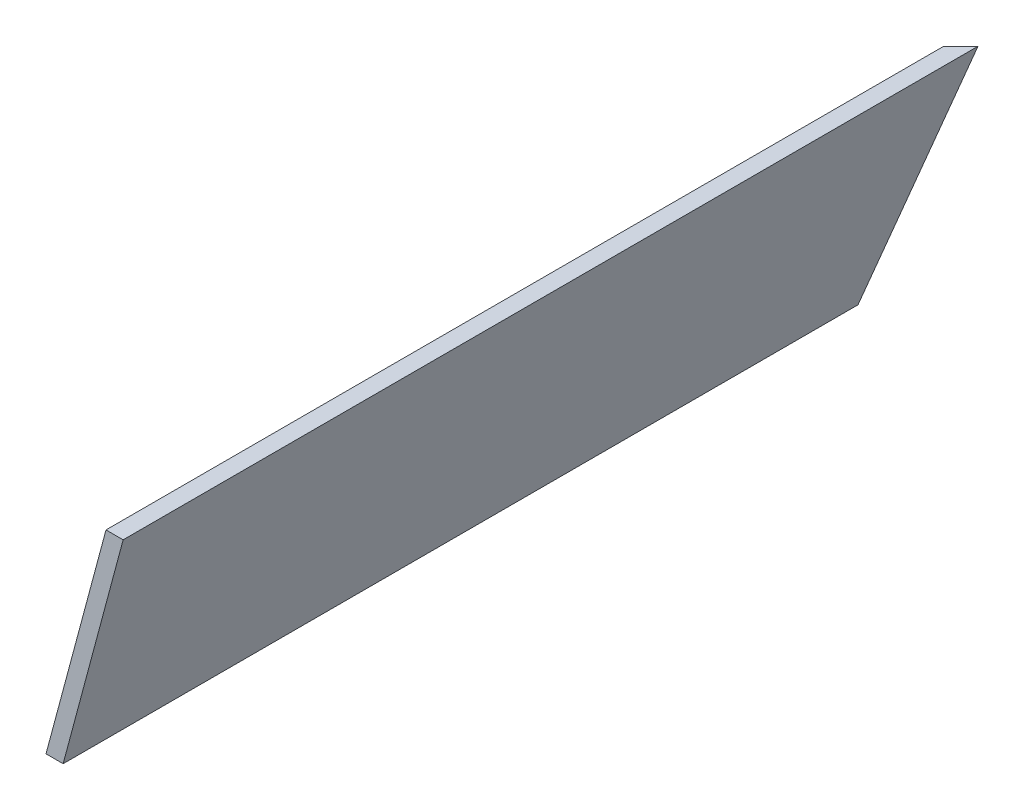
ISO-10303-21;
HEADER;
FILE_DESCRIPTION(('STEP AP214'),'2;1');
FILE_NAME('part.step','',(''),(''),'','','');
FILE_SCHEMA(('AUTOMOTIVE_DESIGN { 1 0 10303 214 1 1 1 1 }'));
ENDSEC;
DATA;
#1=APPLICATION_CONTEXT('core data for automotive mechanical design processes');
#2=APPLICATION_PROTOCOL_DEFINITION('international standard','automotive_design',2000,#1);
#3=PRODUCT_CONTEXT('',#1,'mechanical');
#4=PRODUCT('Part','Part','',(#3));
#5=PRODUCT_RELATED_PRODUCT_CATEGORY('part','',(#4));
#6=PRODUCT_DEFINITION_FORMATION('','',#4);
#7=PRODUCT_DEFINITION_CONTEXT('part definition',#1,'design');
#8=PRODUCT_DEFINITION('design','',#6,#7);
#9=PRODUCT_DEFINITION_SHAPE('','',#8);
#10=(LENGTH_UNIT() NAMED_UNIT(*) SI_UNIT(.MILLI.,.METRE.));
#11=(NAMED_UNIT(*) PLANE_ANGLE_UNIT() SI_UNIT($,.RADIAN.));
#12=(NAMED_UNIT(*) SI_UNIT($,.STERADIAN.) SOLID_ANGLE_UNIT());
#13=UNCERTAINTY_MEASURE_WITH_UNIT(LENGTH_MEASURE(1.E-05),#10,'distance_accuracy_value','');
#14=(GEOMETRIC_REPRESENTATION_CONTEXT(3) GLOBAL_UNCERTAINTY_ASSIGNED_CONTEXT((#13)) GLOBAL_UNIT_ASSIGNED_CONTEXT((#10,
#11,#12)) REPRESENTATION_CONTEXT('',''));
#15=CARTESIAN_POINT('',(0.,0.,0.));
#16=DIRECTION('',(0.,0.,1.));
#17=DIRECTION('',(1.,0.,0.));
#18=AXIS2_PLACEMENT_3D('',#15,#16,#17);
#19=CARTESIAN_POINT('',(642.470018728019,171.741611914197,-845.302893715292));
#20=DIRECTION('',(-0.96592582628907,0.258819045102515,0.));
#21=DIRECTION('',(-0.258819045102515,-0.96592582628907,0.));
#22=AXIS2_PLACEMENT_3D('',#19,#20,#21);
#23=PLANE('',#22);
#24=DIRECTION('',(0.250562807085726,0.935113126531032,-0.250562807085726));
#25=VECTOR('',#24,1.);
#26=CARTESIAN_POINT('',(655.204215552036,219.26628145501,-655.204215552035));
#27=LINE('',#26,#25);
#28=CARTESIAN_POINT('',(596.451992508792,0.,-596.451992508792));
#29=VERTEX_POINT('',#28);
#30=CARTESIAN_POINT('',(642.470018728019,171.741611914197,-642.470018728019));
#31=VERTEX_POINT('',#30);
#32=EDGE_CURVE('E48',#29,#31,#27,.T.);
#33=ORIENTED_EDGE('',*,*,#32,.F.);
#34=DIRECTION('',(0.,0.,1.));
#35=VECTOR('',#34,1.);
#36=CARTESIAN_POINT('',(596.451992508792,0.,-845.302893715292));
#37=LINE('',#36,#35);
#38=CARTESIAN_POINT('',(596.451992508792,0.,0.));
#39=VERTEX_POINT('',#38);
#40=EDGE_CURVE('E76',#29,#39,#37,.T.);
#41=ORIENTED_EDGE('',*,*,#40,.T.);
#42=DIRECTION('',(-0.258819045102515,-0.96592582628907,0.));
#43=VECTOR('',#42,1.);
#44=CARTESIAN_POINT('',(642.470018728019,171.741611914197,0.));
#45=LINE('',#44,#43);
#46=CARTESIAN_POINT('',(642.470018728019,171.741611914197,0.));
#47=VERTEX_POINT('',#46);
#48=EDGE_CURVE('E80',#47,#39,#45,.T.);
#49=ORIENTED_EDGE('',*,*,#48,.F.);
#50=DIRECTION('',(0.,0.,1.));
#51=VECTOR('',#50,1.);
#52=CARTESIAN_POINT('',(642.470018728019,171.741611914197,-845.302893715292));
#53=LINE('',#52,#51);
#54=EDGE_CURVE('E108',#31,#47,#53,.T.);
#55=ORIENTED_EDGE('',*,*,#54,.F.);
#56=EDGE_LOOP('',(#33,#41,#49,#55));
#57=FACE_BOUND('',#56,.T.);
#58=ADVANCED_FACE('F39',(#57),#23,.T.);
#59=CARTESIAN_POINT('',(655.618026219227,171.741611914197,-845.302893715292));
#60=DIRECTION('',(0.,1.,0.));
#61=DIRECTION('',(0.,0.,1.));
#62=AXIS2_PLACEMENT_3D('',#59,#60,#61);
#63=PLANE('',#62);
#64=DIRECTION('',(0.707106781186548,0.,-0.707106781186548));
#65=VECTOR('',#64,1.);
#66=CARTESIAN_POINT('',(750.46045996726,171.741611914197,-750.46045996726));
#67=LINE('',#66,#65);
#68=CARTESIAN_POINT('',(655.618026219227,171.741611914197,-655.618026219227));
#69=VERTEX_POINT('',#68);
#70=EDGE_CURVE('E54',#31,#69,#67,.T.);
#71=ORIENTED_EDGE('',*,*,#70,.F.);
#72=ORIENTED_EDGE('',*,*,#54,.T.);
#73=DIRECTION('',(-1.,0.,0.));
#74=VECTOR('',#73,1.);
#75=CARTESIAN_POINT('',(655.618026219227,171.741611914197,0.));
#76=LINE('',#75,#74);
#77=CARTESIAN_POINT('',(655.618026219227,171.741611914197,0.));
#78=VERTEX_POINT('',#77);
#79=EDGE_CURVE('E86',#78,#47,#76,.T.);
#80=ORIENTED_EDGE('',*,*,#79,.F.);
#81=DIRECTION('',(0.,0.,1.));
#82=VECTOR('',#81,1.);
#83=CARTESIAN_POINT('',(655.618026219227,171.741611914197,-845.302893715292));
#84=LINE('',#83,#82);
#85=EDGE_CURVE('E112',#69,#78,#84,.T.);
#86=ORIENTED_EDGE('',*,*,#85,.F.);
#87=EDGE_LOOP('',(#71,#72,#80,#86));
#88=FACE_BOUND('',#87,.T.);
#89=ADVANCED_FACE('F123',(#88),#63,.T.);
#90=CARTESIAN_POINT('',(609.6,0.,-845.302893715292));
#91=DIRECTION('',(0.96592582628907,-0.258819045102515,0.));
#92=DIRECTION('',(0.258819045102515,0.96592582628907,0.));
#93=AXIS2_PLACEMENT_3D('',#90,#91,#92);
#94=PLANE('',#93);
#95=DIRECTION('',(-0.250562807085726,-0.935113126531032,0.250562807085726));
#96=VECTOR('',#95,1.);
#97=CARTESIAN_POINT('',(624.39783314588,55.2262651423519,-624.39783314588));
#98=LINE('',#97,#96);
#99=CARTESIAN_POINT('',(609.6,0.,-609.6));
#100=VERTEX_POINT('',#99);
#101=EDGE_CURVE('E111',#69,#100,#98,.T.);
#102=ORIENTED_EDGE('',*,*,#101,.F.);
#103=ORIENTED_EDGE('',*,*,#85,.T.);
#104=DIRECTION('',(0.258819045102515,0.96592582628907,0.));
#105=VECTOR('',#104,1.);
#106=CARTESIAN_POINT('',(609.6,0.,0.));
#107=LINE('',#106,#105);
#108=CARTESIAN_POINT('',(609.6,0.,0.));
#109=VERTEX_POINT('',#108);
#110=EDGE_CURVE('E95',#109,#78,#107,.T.);
#111=ORIENTED_EDGE('',*,*,#110,.F.);
#112=DIRECTION('',(0.,0.,1.));
#113=VECTOR('',#112,1.);
#114=CARTESIAN_POINT('',(609.6,0.,-845.302893715292));
#115=LINE('',#114,#113);
#116=EDGE_CURVE('E85',#100,#109,#115,.T.);
#117=ORIENTED_EDGE('',*,*,#116,.F.);
#118=EDGE_LOOP('',(#102,#103,#111,#117));
#119=FACE_BOUND('',#118,.T.);
#120=ADVANCED_FACE('F125',(#119),#94,.T.);
#121=CARTESIAN_POINT('',(596.451992508792,0.,-845.302893715292));
#122=DIRECTION('',(0.,-1.,0.));
#123=DIRECTION('',(0.,0.,-1.));
#124=AXIS2_PLACEMENT_3D('',#121,#122,#123);
#125=PLANE('',#124);
#126=DIRECTION('',(-0.707106781186548,0.,0.707106781186548));
#127=VECTOR('',#126,1.);
#128=CARTESIAN_POINT('',(720.877443112042,0.,-720.877443112042));
#129=LINE('',#128,#127);
#130=EDGE_CURVE('E11',#100,#29,#129,.T.);
#131=ORIENTED_EDGE('',*,*,#130,.F.);
#132=ORIENTED_EDGE('',*,*,#116,.T.);
#133=DIRECTION('',(1.,0.,0.));
#134=VECTOR('',#133,1.);
#135=CARTESIAN_POINT('',(596.451992508792,0.,0.));
#136=LINE('',#135,#134);
#137=EDGE_CURVE('E88',#39,#109,#136,.T.);
#138=ORIENTED_EDGE('',*,*,#137,.F.);
#139=ORIENTED_EDGE('',*,*,#40,.F.);
#140=EDGE_LOOP('',(#131,#132,#138,#139));
#141=FACE_BOUND('',#140,.T.);
#142=ADVANCED_FACE('F89',(#141),#125,.T.);
#143=CARTESIAN_POINT('',(0.,0.,0.));
#144=DIRECTION('',(0.,0.,1.));
#145=DIRECTION('',(1.,0.,0.));
#146=AXIS2_PLACEMENT_3D('',#143,#144,#145);
#147=PLANE('',#146);
#148=ORIENTED_EDGE('',*,*,#48,.T.);
#149=ORIENTED_EDGE('',*,*,#137,.T.);
#150=ORIENTED_EDGE('',*,*,#110,.T.);
#151=ORIENTED_EDGE('',*,*,#79,.T.);
#152=EDGE_LOOP('',(#148,#149,#150,#151));
#153=FACE_BOUND('',#152,.T.);
#154=ADVANCED_FACE('F97',(#153),#147,.T.);
#155=CARTESIAN_POINT('',(0.,0.,0.));
#156=DIRECTION('',(0.707106781186548,0.,0.707106781186548));
#157=DIRECTION('',(0.707106781186548,0.,-0.707106781186548));
#158=AXIS2_PLACEMENT_3D('',#155,#156,#157);
#159=PLANE('',#158);
#160=ORIENTED_EDGE('',*,*,#32,.T.);
#161=ORIENTED_EDGE('',*,*,#70,.T.);
#162=ORIENTED_EDGE('',*,*,#101,.T.);
#163=ORIENTED_EDGE('',*,*,#130,.T.);
#164=EDGE_LOOP('',(#160,#161,#162,#163));
#165=FACE_BOUND('',#164,.T.);
#166=ADVANCED_FACE('F120',(#165),#159,.F.);
#167=CLOSED_SHELL('',(#58,#89,#120,#142,#154,#166));
#168=MANIFOLD_SOLID_BREP('B2',#167);
#169=ADVANCED_BREP_SHAPE_REPRESENTATION('',(#18,#168),#14);
#170=SHAPE_DEFINITION_REPRESENTATION(#9,#169);
ENDSEC;
END-ISO-10303-21;
